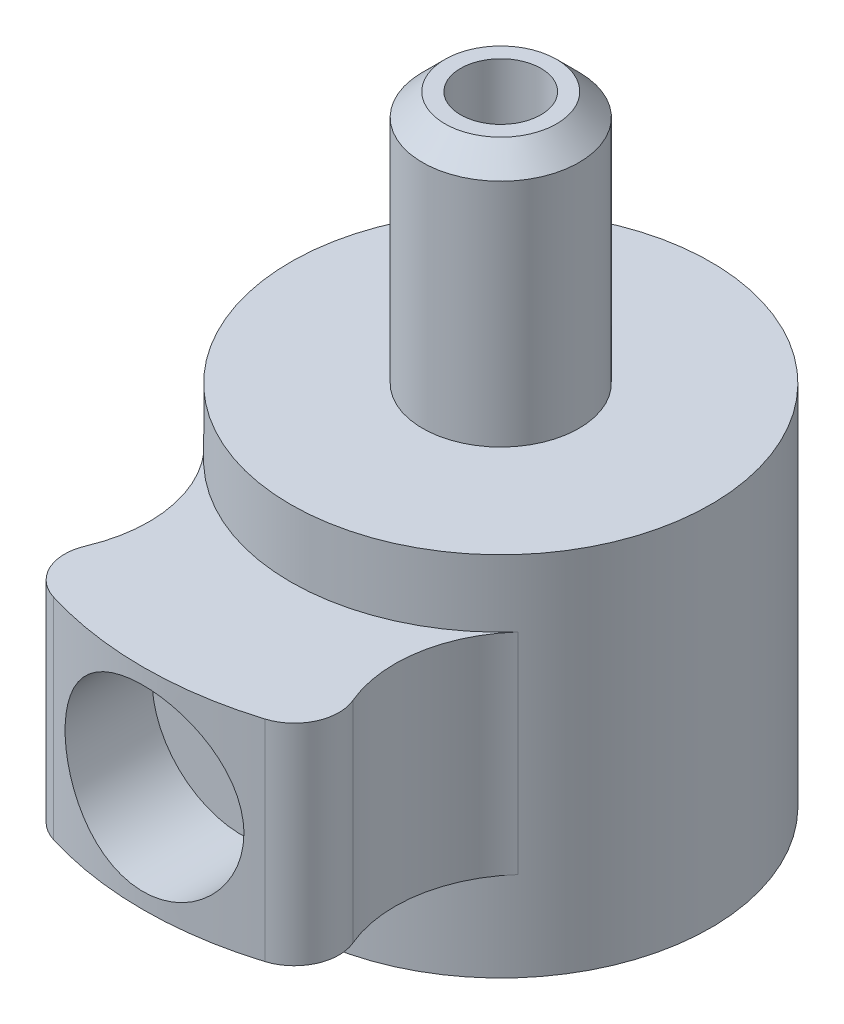
ISO-10303-21;
HEADER;
FILE_DESCRIPTION(('STEP AP214'),'2;1');
FILE_NAME('part.step','',(''),(''),'','','');
FILE_SCHEMA(('AUTOMOTIVE_DESIGN { 1 0 10303 214 1 1 1 1 }'));
ENDSEC;
DATA;
#1=APPLICATION_CONTEXT('core data for automotive mechanical design processes');
#2=APPLICATION_PROTOCOL_DEFINITION('international standard','automotive_design',2000,#1);
#3=PRODUCT_CONTEXT('',#1,'mechanical');
#4=PRODUCT('Part','Part','',(#3));
#5=PRODUCT_RELATED_PRODUCT_CATEGORY('part','',(#4));
#6=PRODUCT_DEFINITION_FORMATION('','',#4);
#7=PRODUCT_DEFINITION_CONTEXT('part definition',#1,'design');
#8=PRODUCT_DEFINITION('design','',#6,#7);
#9=PRODUCT_DEFINITION_SHAPE('','',#8);
#10=(LENGTH_UNIT() NAMED_UNIT(*) SI_UNIT(.MILLI.,.METRE.));
#11=(NAMED_UNIT(*) PLANE_ANGLE_UNIT() SI_UNIT($,.RADIAN.));
#12=(NAMED_UNIT(*) SI_UNIT($,.STERADIAN.) SOLID_ANGLE_UNIT());
#13=UNCERTAINTY_MEASURE_WITH_UNIT(LENGTH_MEASURE(1.E-05),#10,'distance_accuracy_value','');
#14=(GEOMETRIC_REPRESENTATION_CONTEXT(3) GLOBAL_UNCERTAINTY_ASSIGNED_CONTEXT((#13)) GLOBAL_UNIT_ASSIGNED_CONTEXT((#10,
#11,#12)) REPRESENTATION_CONTEXT('',''));
#15=CARTESIAN_POINT('',(0.,0.,0.));
#16=DIRECTION('',(0.,0.,1.));
#17=DIRECTION('',(1.,0.,0.));
#18=AXIS2_PLACEMENT_3D('',#15,#16,#17);
#19=CARTESIAN_POINT('',(0.,4.35,8.));
#20=DIRECTION('',(0.,0.,1.));
#21=DIRECTION('',(1.,0.,0.));
#22=AXIS2_PLACEMENT_3D('',#19,#20,#21);
#23=CYLINDRICAL_SURFACE('',#22,0.799999999999989);
#24=CARTESIAN_POINT('',(0.79999999999999,4.35,3.30454232837166));
#25=CARTESIAN_POINT('',(0.799998604853544,4.39426375756391,3.30454321037376));
#26=CARTESIAN_POINT('',(0.796313843485802,4.4385435743924,3.30544138740471));
#27=CARTESIAN_POINT('',(0.781692042569201,4.52583763979242,3.30892913746021));
#28=CARTESIAN_POINT('',(0.770750288807348,4.56885104670976,3.31151980992989));
#29=CARTESIAN_POINT('',(0.741983335663095,4.6523370042018,3.31808326909352));
#30=CARTESIAN_POINT('',(0.724166370983085,4.69281252733256,3.32205440179561));
#31=CARTESIAN_POINT('',(0.682179146705426,4.77020273129312,3.33092931117993));
#32=CARTESIAN_POINT('',(0.65800880947241,4.80711736860295,3.3358330992586));
#33=CARTESIAN_POINT('',(0.603497582949992,4.87705853668256,3.34612782427964));
#34=CARTESIAN_POINT('',(0.573055762178637,4.91000538070273,3.35152580520682));
#35=CARTESIAN_POINT('',(0.507083348356182,4.97037570264705,3.36213932660775));
#36=CARTESIAN_POINT('',(0.471552320294814,4.99779870792727,3.36735485143824));
#37=CARTESIAN_POINT('',(0.395869778023862,5.04666370971395,3.37709316623333));
#38=CARTESIAN_POINT('',(0.355666932686409,5.06802821359437,3.38160667396126));
#39=CARTESIAN_POINT('',(0.272117140458808,5.1036671209406,3.38935242786689));
#40=CARTESIAN_POINT('',(0.228770603944949,5.1179424479226,3.39258484092336));
#41=CARTESIAN_POINT('',(0.140993633396821,5.13874476638707,3.39735441310736));
#42=CARTESIAN_POINT('',(0.0965968511202841,5.14540686878142,3.39892109757437));
#43=CARTESIAN_POINT('',(0.00729001228250653,5.1512169190143,3.40028529140342));
#44=CARTESIAN_POINT('',(-0.0376199759533668,5.15036585573734,3.40008303359406));
#45=CARTESIAN_POINT('',(-0.125744085747008,5.14127258822537,3.39795439581618));
#46=CARTESIAN_POINT('',(-0.168974188717624,5.13317611902805,3.3960620127208));
#47=CARTESIAN_POINT('',(-0.253444194557819,5.11005513697513,3.39080491612124));
#48=CARTESIAN_POINT('',(-0.294683998618074,5.09503028054652,3.3874401296022));
#49=CARTESIAN_POINT('',(-0.37439669293612,5.05835582155591,3.37956298571922));
#50=CARTESIAN_POINT('',(-0.412844023280618,5.03665272441056,3.37504141336383));
#51=CARTESIAN_POINT('',(-0.485603092257449,4.98727808223394,3.36534379681458));
#52=CARTESIAN_POINT('',(-0.519914184798019,4.9596056066475,3.36016765063254));
#53=CARTESIAN_POINT('',(-0.58429496276928,4.89829044163603,3.34958069347214));
#54=CARTESIAN_POINT('',(-0.614242924654353,4.86452027514467,3.34416723239309));
#55=CARTESIAN_POINT('',(-0.668075659733524,4.79238047631,3.33383089946015));
#56=CARTESIAN_POINT('',(-0.691960211822533,4.75401067631398,3.32890804550046));
#57=CARTESIAN_POINT('',(-0.733054277700717,4.6735425735572,3.32010193553592));
#58=CARTESIAN_POINT('',(-0.750237573422676,4.63143040216961,3.31622278089562));
#59=CARTESIAN_POINT('',(-0.7772447410378,4.54480250234333,3.3099976941517));
#60=CARTESIAN_POINT('',(-0.787069986500058,4.50028722417048,3.30765147589655));
#61=CARTESIAN_POINT('',(-0.798886634509435,4.41123754267958,3.304817170585));
#62=CARTESIAN_POINT('',(-0.801056681017307,4.36672816510349,3.30428671915616));
#63=CARTESIAN_POINT('',(-0.797987783934305,4.27798350741057,3.30502919153972));
#64=CARTESIAN_POINT('',(-0.792749436914119,4.23374820551151,3.30630197014466));
#65=CARTESIAN_POINT('',(-0.775168317976514,4.14745046377477,3.31046717921145));
#66=CARTESIAN_POINT('',(-0.762926804509054,4.10536617530986,3.3133365093543));
#67=CARTESIAN_POINT('',(-0.731797823701936,4.02384639846666,3.32035011935363));
#68=CARTESIAN_POINT('',(-0.712909640388007,3.98441119599115,3.3244945365555));
#69=CARTESIAN_POINT('',(-0.668640078279623,3.90854421775662,3.3336824259049));
#70=CARTESIAN_POINT('',(-0.643150316083848,3.87217748307256,3.33874043169574));
#71=CARTESIAN_POINT('',(-0.586540496532733,3.80417193908381,3.34914866018982));
#72=CARTESIAN_POINT('',(-0.555419624205654,3.77253381534701,3.35449892511241));
#73=CARTESIAN_POINT('',(-0.487616637245103,3.7141746804257,3.36503050843004));
#74=CARTESIAN_POINT('',(-0.450827746323671,3.68757639432678,3.370205569405));
#75=CARTESIAN_POINT('',(-0.373200963518472,3.64093657132093,3.37968159158292));
#76=CARTESIAN_POINT('',(-0.332363274464459,3.62089470617772,3.38398259653996));
#77=CARTESIAN_POINT('',(-0.248069771459096,3.58809973256274,3.39119987995177));
#78=CARTESIAN_POINT('',(-0.204634189931106,3.57529679475447,3.39412560107054));
#79=CARTESIAN_POINT('',(-0.116151072350095,3.55719026566033,3.39830377407843));
#80=CARTESIAN_POINT('',(-0.0711038110727765,3.55188540221391,3.39955650981256));
#81=CARTESIAN_POINT('',(0.0181652939843413,3.5489902529377,3.40023750537373));
#82=CARTESIAN_POINT('',(0.062380998597955,3.55121786188949,3.39970883363818));
#83=CARTESIAN_POINT('',(0.149789044922906,3.5629120700921,3.3969803510083));
#84=CARTESIAN_POINT('',(0.192981410922304,3.57237849735801,3.39478057981714));
#85=CARTESIAN_POINT('',(0.276950110243137,3.59818879841435,3.38896207325541));
#86=CARTESIAN_POINT('',(0.317735964938134,3.61450315861507,3.38534943165835));
#87=CARTESIAN_POINT('',(0.396013765353372,3.6535187261056,3.3770880965855));
#88=CARTESIAN_POINT('',(0.433505339179073,3.67622065328147,3.37243928634463));
#89=CARTESIAN_POINT('',(0.505006165498286,3.72794099127646,3.36248438194576));
#90=CARTESIAN_POINT('',(0.538922754078283,3.75708519790852,3.35716626354667));
#91=CARTESIAN_POINT('',(0.601445897097706,3.82061388897884,3.34653117447955));
#92=CARTESIAN_POINT('',(0.630051139203705,3.85499966469834,3.34121420441853));
#93=CARTESIAN_POINT('',(0.681585676235505,3.92869832358532,3.33108742985021));
#94=CARTESIAN_POINT('',(0.704416720440091,3.96808130308556,3.32628711270982));
#95=CARTESIAN_POINT('',(0.743099584973279,4.0502321488081,3.31786042879568));
#96=CARTESIAN_POINT('',(0.758956892918538,4.09299732221021,3.31423313956606));
#97=CARTESIAN_POINT('',(0.780650248439628,4.17145688863508,3.30918120129895));
#98=CARTESIAN_POINT('',(0.787891539204312,4.20674992335564,3.30745394394094));
#99=CARTESIAN_POINT('',(0.797566824226479,4.27802512955251,3.3051341861726));
#100=CARTESIAN_POINT('',(0.80000113445292,4.31400725557699,3.30454161117824));
#101=CARTESIAN_POINT('',(0.79999999999999,4.35,3.30454232837166));
#102=B_SPLINE_CURVE_WITH_KNOTS('',3,(#24,#25,#26,#27,#28,#29,#30,#31,#32,#33,#34,#35,#36,#37,
#38,#39,#40,#41,#42,#43,#44,#45,#46,#47,#48,#49,#50,#51,#52,#53,#54,#55,#56,#57,#58,#59,#60,#61,
#62,#63,#64,#65,#66,#67,#68,#69,#70,#71,#72,#73,#74,#75,#76,#77,#78,#79,#80,#81,#82,#83,#84,#85,
#86,#87,#88,#89,#90,#91,#92,#93,#94,#95,#96,#97,#98,#99,#100,#101),.UNSPECIFIED.,.T.,.F.,(4,2,2,
2,2,2,2,2,2,2,2,2,2,2,2,2,2,2,2,2,2,2,2,2,2,2,2,2,2,2,2,2,2,2,2,2,2,2,4),(0.,0.132659230314079,
0.265404721873799,0.397991710141676,0.530580318638497,0.665497920554681,0.800427061715096,
0.937011317755035,1.07357777611783,1.20768101501322,1.3417666034742,1.47321433089912,
1.60466857740937,1.7372044986078,1.86976109553144,2.00550280029183,2.14124945422651,
2.27752200083875,2.41376910233417,2.54681486555971,2.67984991570916,2.81100835307798,
2.94218092306192,3.07566109422861,3.2091605990082,3.34558091204578,3.48199439438217,
3.6174570678504,3.75289675528848,3.88508569129767,4.01727148676701,4.14889333725167,
4.2805300276142,4.41500887591735,4.54952090731742,4.68618742942708,4.82274621570191,
4.93062417088764,5.0384950348818),.UNSPECIFIED.);
#103=CARTESIAN_POINT('',(0.79999999999999,4.35,3.30454232837166));
#104=VERTEX_POINT('',#103);
#105=EDGE_CURVE('E123',#104,#104,#102,.T.);
#106=ORIENTED_EDGE('',*,*,#105,.F.);
#107=EDGE_LOOP('',(#106));
#108=FACE_BOUND('',#107,.T.);
#109=CARTESIAN_POINT('',(0.,4.35,5.8));
#110=DIRECTION('',(0.,0.,1.));
#111=DIRECTION('',(1.,0.,0.));
#112=AXIS2_PLACEMENT_3D('',#109,#110,#111);
#113=CIRCLE('',#112,0.799999999999989);
#114=CARTESIAN_POINT('',(0.79999999999999,4.35,5.8));
#115=VERTEX_POINT('',#114);
#116=EDGE_CURVE('E190',#115,#115,#113,.F.);
#117=ORIENTED_EDGE('',*,*,#116,.F.);
#118=EDGE_LOOP('',(#117));
#119=FACE_BOUND('',#118,.T.);
#120=ADVANCED_FACE('F49',(#108,#119),#23,.F.);
#121=CARTESIAN_POINT('',(0.,0.,0.));
#122=DIRECTION('',(0.,-1.,0.));
#123=DIRECTION('',(0.,0.,-1.));
#124=AXIS2_PLACEMENT_3D('',#121,#122,#123);
#125=CYLINDRICAL_SURFACE('',#124,8.);
#126=CARTESIAN_POINT('',(2.,4.35,7.74596669241483));
#127=CARTESIAN_POINT('',(1.99999686287446,4.23955939925874,7.74596880070288));
#128=CARTESIAN_POINT('',(1.99082099639812,4.12908408105718,7.74835444811678));
#129=CARTESIAN_POINT('',(1.95441850037104,3.91130593746119,7.75761489594051));
#130=CARTESIAN_POINT('',(1.92718136539368,3.80400499642545,7.76449230897304));
#131=CARTESIAN_POINT('',(1.85559295970563,3.59575716945025,7.7819097967692));
#132=CARTESIAN_POINT('',(1.81126378228359,3.49480227569143,7.79244514152366));
#133=CARTESIAN_POINT('',(1.70681691300911,3.30175131796809,7.81598553623007));
#134=CARTESIAN_POINT('',(1.64669855084855,3.20965563033583,7.82899069102791));
#135=CARTESIAN_POINT('',(1.51096674184951,3.03491068379023,7.856325730845));
#136=CARTESIAN_POINT('',(1.43506951016324,2.95248511971996,7.87067678098427));
#137=CARTESIAN_POINT('',(1.27054565128053,2.80139088451173,7.89890300412235));
#138=CARTESIAN_POINT('',(1.18191783534425,2.7327234995026,7.91277813253111));
#139=CARTESIAN_POINT('',(0.992916160863164,2.61017962589498,7.93872332416466));
#140=CARTESIAN_POINT('',(0.892395660956097,2.55652288947083,7.95076549920474));
#141=CARTESIAN_POINT('',(0.68341054743421,2.46695228467753,7.97144649540787));
#142=CARTESIAN_POINT('',(0.574947108633553,2.43103579846759,7.98008581867475));
#143=CARTESIAN_POINT('',(0.35548700700333,2.37868173233713,7.99283807078544));
#144=CARTESIAN_POINT('',(0.244586175639181,2.36186428453873,7.99703915075451));
#145=CARTESIAN_POINT('',(0.021463055410216,2.34699329657956,8.00074875285838));
#146=CARTESIAN_POINT('',(-0.0907590356304544,2.34893698223232,8.00025796877363));
#147=CARTESIAN_POINT('',(-0.310704494344774,2.37125988020011,7.99470475962828));
#148=CARTESIAN_POINT('',(-0.418472431202134,2.39122906004308,7.98974401872699));
#149=CARTESIAN_POINT('',(-0.629076494827372,2.4483770160388,7.97592669219883));
#150=CARTESIAN_POINT('',(-0.731912358740876,2.48555670830193,7.96706989918753));
#151=CARTESIAN_POINT('',(-0.930813407003613,2.57640205654965,7.94630007760717));
#152=CARTESIAN_POINT('',(-1.02680901953301,2.6302136357294,7.93436015756043));
#153=CARTESIAN_POINT('',(-1.20855124468098,2.75268454329301,7.90871923047719));
#154=CARTESIAN_POINT('',(-1.29429607017101,2.8213464548485,7.89501791721992));
#155=CARTESIAN_POINT('',(-1.45554807016991,2.9737669935859,7.86690971015616));
#156=CARTESIAN_POINT('',(-1.5307153581504,3.05788391387822,7.85249375620734));
#157=CARTESIAN_POINT('',(-1.66595275192604,3.2376799788322,7.82492034813365));
#158=CARTESIAN_POINT('',(-1.72602215209203,3.3333596635928,7.81176295284776));
#159=CARTESIAN_POINT('',(-1.8295762580452,3.53423202731917,7.78816397465319));
#160=CARTESIAN_POINT('',(-1.87297913394098,3.63946858425056,7.77773586980577));
#161=CARTESIAN_POINT('',(-1.94137124127268,3.85606837446116,7.76094912111966));
#162=CARTESIAN_POINT('',(-1.96636441310582,3.96743029118651,7.75458960648175));
#163=CARTESIAN_POINT('',(-1.99666371093214,4.1899676012185,7.74684284831313));
#164=CARTESIAN_POINT('',(-2.0024723791357,4.3010702346637,7.74532871274919));
#165=CARTESIAN_POINT('',(-1.99561359241244,4.52265754926253,7.74709874784831));
#166=CARTESIAN_POINT('',(-1.98294783827904,4.63314228636099,7.75038247681013));
#167=CARTESIAN_POINT('',(-1.93994037115013,4.84849141196377,7.76125665563648));
#168=CARTESIAN_POINT('',(-1.9098912546254,4.95341818125667,7.768775761875));
#169=CARTESIAN_POINT('',(-1.8332944653365,5.15674516628135,7.7872057461677));
#170=CARTESIAN_POINT('',(-1.78674483817004,5.25514460724427,7.79811702598891));
#171=CARTESIAN_POINT('',(-1.67741653434924,5.44475302229388,7.8223690967461));
#172=CARTESIAN_POINT('',(-1.6143374030685,5.53578307203448,7.83575334885313));
#173=CARTESIAN_POINT('',(-1.47412058586891,5.70615069024108,7.86333666457373));
#174=CARTESIAN_POINT('',(-1.39698058961088,5.78548633332006,7.87753586182776));
#175=CARTESIAN_POINT('',(-1.22852544196945,5.93224883405677,7.90557922425285));
#176=CARTESIAN_POINT('',(-1.13690390506318,5.99932805003905,7.91940561649468));
#177=CARTESIAN_POINT('',(-0.943405365389349,6.117148693561,7.94477773290987));
#178=CARTESIAN_POINT('',(-0.84152889791518,6.16789097328656,7.95632357603169));
#179=CARTESIAN_POINT('',(-0.63111640346218,6.25115682762235,7.9757609259065));
#180=CARTESIAN_POINT('',(-0.522634762055763,6.28381142750325,7.98367864017925));
#181=CARTESIAN_POINT('',(-0.301499520637613,6.33036826768673,7.99508234716634));
#182=CARTESIAN_POINT('',(-0.18884673008248,6.34427412699123,7.99856919514738));
#183=CARTESIAN_POINT('',(0.0341670528866473,6.35273517915108,8.00068338817612));
#184=CARTESIAN_POINT('',(0.144507653932044,6.34780341819082,7.99943957759977));
#185=CARTESIAN_POINT('',(0.362734992829502,6.3199043454113,7.99251792914887));
#186=CARTESIAN_POINT('',(0.470621803561858,6.29693756997366,7.98684022314338));
#187=CARTESIAN_POINT('',(0.680342071289549,6.23389556045828,7.97170865707778));
#188=CARTESIAN_POINT('',(0.782204989161727,6.19391309337124,7.96227529004785));
#189=CARTESIAN_POINT('',(0.977834106083249,6.09805884196086,7.94062577827316));
#190=CARTESIAN_POINT('',(1.07159928253127,6.04218505465903,7.92840928277515));
#191=CARTESIAN_POINT('',(1.25080385684661,5.91456953200773,7.90214499360574));
#192=CARTESIAN_POINT('',(1.33598997659667,5.84247971419234,7.88806033883329));
#193=CARTESIAN_POINT('',(1.49323004054701,5.68515429604531,7.85981298114379));
#194=CARTESIAN_POINT('',(1.56528065015318,5.59991536777767,7.84565025934604));
#195=CARTESIAN_POINT('',(1.69552405294366,5.41679717162108,7.81854951691005));
#196=CARTESIAN_POINT('',(1.75343323883276,5.31871175326949,7.80563927346578));
#197=CARTESIAN_POINT('',(1.85185379317094,5.11388902025036,7.78287910989656));
#198=CARTESIAN_POINT('',(1.89237781950431,5.00715806781231,7.77302696466428));
#199=CARTESIAN_POINT('',(1.94884505714201,4.80884597632968,7.75903817501475));
#200=CARTESIAN_POINT('',(1.96798634119376,4.71821367122773,7.75417326006998));
#201=CARTESIAN_POINT('',(1.99356458514354,4.53506226200462,7.7476367716524));
#202=CARTESIAN_POINT('',(2.0000026287435,4.4425433195112,7.74596492578215));
#203=CARTESIAN_POINT('',(2.,4.35,7.74596669241483));
#204=B_SPLINE_CURVE_WITH_KNOTS('',3,(#126,#127,#128,#129,#130,#131,#132,#133,#134,#135,#136,
#137,#138,#139,#140,#141,#142,#143,#144,#145,#146,#147,#148,#149,#150,#151,#152,#153,#154,#155,
#156,#157,#158,#159,#160,#161,#162,#163,#164,#165,#166,#167,#168,#169,#170,#171,#172,#173,#174,
#175,#176,#177,#178,#179,#180,#181,#182,#183,#184,#185,#186,#187,#188,#189,#190,#191,#192,#193,
#194,#195,#196,#197,#198,#199,#200,#201,#202,#203),.UNSPECIFIED.,.T.,.F.,(4,2,2,2,2,2,2,2,2,2,2,
2,2,2,2,2,2,2,2,2,2,2,2,2,2,2,2,2,2,2,2,2,2,2,2,2,2,2,4),(0.,0.33098195338891,0.662156593142933,
0.992904581732817,1.32366661404383,1.66099163354381,1.99834817183893,2.34041197118336,
2.68242527877674,3.01751000796277,3.35254518932816,3.68014610151158,4.00776445379829,
4.33834299403556,4.66897908375131,5.0085637325753,5.34816424959842,5.68941145606722,
6.03058560103638,6.36274859809374,6.69488101747042,7.02157924007366,7.34831617137135,
7.68146276687326,8.01466415108036,8.35620264772255,8.69772332575643,9.03673658245544,
9.37568439127231,9.70546756901965,10.0352409390158,10.3632390124777,10.6912784459046,
11.0271767726566,11.3631602525241,11.7054118182895,12.0474137709606,12.3247826174462,
12.6021278008238),.UNSPECIFIED.);
#205=CARTESIAN_POINT('',(2.,4.35,7.74596669241483));
#206=VERTEX_POINT('',#205);
#207=EDGE_CURVE('E12',#206,#206,#204,.T.);
#208=ORIENTED_EDGE('',*,*,#207,.T.);
#209=EDGE_LOOP('',(#208));
#210=FACE_BOUND('',#209,.T.);
#211=CARTESIAN_POINT('',(0.,2.,0.));
#212=DIRECTION('',(0.,-1.,0.));
#213=DIRECTION('',(0.,0.,-1.));
#214=AXIS2_PLACEMENT_3D('',#211,#212,#213);
#215=CIRCLE('',#214,8.);
#216=CARTESIAN_POINT('',(2.36484696607376,2.,7.64247988725203));
#217=VERTEX_POINT('',#216);
#218=CARTESIAN_POINT('',(-2.36484696607376,2.,7.64247988725203));
#219=VERTEX_POINT('',#218);
#220=EDGE_CURVE('E292',#217,#219,#215,.T.);
#221=ORIENTED_EDGE('',*,*,#220,.F.);
#222=DIRECTION('',(0.,-1.,0.));
#223=VECTOR('',#222,1.);
#224=CARTESIAN_POINT('',(2.36484696607376,0.,7.64247988725203));
#225=LINE('',#224,#223);
#226=CARTESIAN_POINT('',(2.36484696607376,6.7,7.64247988725203));
#227=VERTEX_POINT('',#226);
#228=EDGE_CURVE('E173',#217,#227,#225,.F.);
#229=ORIENTED_EDGE('',*,*,#228,.T.);
#230=CARTESIAN_POINT('',(0.,6.7,0.));
#231=DIRECTION('',(0.,1.,0.));
#232=DIRECTION('',(0.,0.,1.));
#233=AXIS2_PLACEMENT_3D('',#230,#231,#232);
#234=CIRCLE('',#233,8.);
#235=CARTESIAN_POINT('',(-2.36484696607376,6.7,7.64247988725203));
#236=VERTEX_POINT('',#235);
#237=EDGE_CURVE('E282',#236,#227,#234,.T.);
#238=ORIENTED_EDGE('',*,*,#237,.F.);
#239=DIRECTION('',(0.,-1.,0.));
#240=VECTOR('',#239,1.);
#241=CARTESIAN_POINT('',(-2.36484696607376,0.,7.64247988725203));
#242=LINE('',#241,#240);
#243=EDGE_CURVE('E169',#236,#219,#242,.T.);
#244=ORIENTED_EDGE('',*,*,#243,.T.);
#245=EDGE_LOOP('',(#221,#229,#238,#244));
#246=FACE_BOUND('',#245,.T.);
#247=ADVANCED_FACE('F217',(#210,#246),#125,.T.);
#248=CARTESIAN_POINT('',(5.75,0.,5.12127913709065));
#249=DIRECTION('',(0.,1.,0.));
#250=DIRECTION('',(0.,0.,1.));
#251=AXIS2_PLACEMENT_3D('',#248,#249,#250);
#252=CYLINDRICAL_SURFACE('',#251,3.);
#253=CARTESIAN_POINT('',(5.75,2.,5.12127913709065));
#254=DIRECTION('',(0.,-1.,0.));
#255=DIRECTION('',(0.,0.,-1.));
#256=AXIS2_PLACEMENT_3D('',#253,#254,#255);
#257=CIRCLE('',#256,3.);
#258=CARTESIAN_POINT('',(3.50974025974026,2.,3.1259755771852));
#259=VERTEX_POINT('',#258);
#260=CARTESIAN_POINT('',(2.9894308214859,2.,6.29569721028181));
#261=VERTEX_POINT('',#260);
#262=EDGE_CURVE('E115',#259,#261,#257,.F.);
#263=ORIENTED_EDGE('',*,*,#262,.F.);
#264=DIRECTION('',(0.,1.,0.));
#265=VECTOR('',#264,1.);
#266=CARTESIAN_POINT('',(3.50974025974026,0.,3.12597557718521));
#267=LINE('',#266,#265);
#268=CARTESIAN_POINT('',(3.50974025974026,6.7,3.1259755771852));
#269=VERTEX_POINT('',#268);
#270=EDGE_CURVE('E128',#259,#269,#267,.T.);
#271=ORIENTED_EDGE('',*,*,#270,.T.);
#272=CARTESIAN_POINT('',(5.75,6.7,5.12127913709065));
#273=DIRECTION('',(0.,1.,0.));
#274=DIRECTION('',(0.,0.,1.));
#275=AXIS2_PLACEMENT_3D('',#272,#273,#274);
#276=CIRCLE('',#275,3.);
#277=CARTESIAN_POINT('',(2.9894308214859,6.7,6.29569721028181));
#278=VERTEX_POINT('',#277);
#279=EDGE_CURVE('E276',#278,#269,#276,.F.);
#280=ORIENTED_EDGE('',*,*,#279,.F.);
#281=DIRECTION('',(0.,1.,0.));
#282=VECTOR('',#281,1.);
#283=CARTESIAN_POINT('',(2.9894308214859,0.,6.29569721028181));
#284=LINE('',#283,#282);
#285=EDGE_CURVE('E130',#278,#261,#284,.F.);
#286=ORIENTED_EDGE('',*,*,#285,.T.);
#287=EDGE_LOOP('',(#263,#271,#280,#286));
#288=FACE_BOUND('',#287,.T.);
#289=ADVANCED_FACE('F127',(#288),#252,.F.);
#290=CARTESIAN_POINT('',(-5.75,0.,5.12127913709065));
#291=DIRECTION('',(0.,1.,0.));
#292=DIRECTION('',(0.,0.,1.));
#293=AXIS2_PLACEMENT_3D('',#290,#291,#292);
#294=CYLINDRICAL_SURFACE('',#293,3.);
#295=CARTESIAN_POINT('',(-5.75,2.,5.12127913709065));
#296=DIRECTION('',(0.,-1.,0.));
#297=DIRECTION('',(0.,0.,-1.));
#298=AXIS2_PLACEMENT_3D('',#295,#296,#297);
#299=CIRCLE('',#298,3.);
#300=CARTESIAN_POINT('',(-2.9894308214859,2.,6.29569721028181));
#301=VERTEX_POINT('',#300);
#302=CARTESIAN_POINT('',(-3.50974025974026,2.,3.12597557718521));
#303=VERTEX_POINT('',#302);
#304=EDGE_CURVE('E117',#301,#303,#299,.F.);
#305=ORIENTED_EDGE('',*,*,#304,.F.);
#306=DIRECTION('',(0.,1.,0.));
#307=VECTOR('',#306,1.);
#308=CARTESIAN_POINT('',(-2.9894308214859,0.,6.29569721028181));
#309=LINE('',#308,#307);
#310=CARTESIAN_POINT('',(-2.9894308214859,6.7,6.29569721028181));
#311=VERTEX_POINT('',#310);
#312=EDGE_CURVE('E71',#301,#311,#309,.T.);
#313=ORIENTED_EDGE('',*,*,#312,.T.);
#314=CARTESIAN_POINT('',(-5.75,6.7,5.12127913709065));
#315=DIRECTION('',(0.,1.,0.));
#316=DIRECTION('',(0.,0.,1.));
#317=AXIS2_PLACEMENT_3D('',#314,#315,#316);
#318=CIRCLE('',#317,3.);
#319=CARTESIAN_POINT('',(-3.50974025974026,6.7,3.12597557718521));
#320=VERTEX_POINT('',#319);
#321=EDGE_CURVE('E285',#320,#311,#318,.F.);
#322=ORIENTED_EDGE('',*,*,#321,.F.);
#323=DIRECTION('',(0.,1.,0.));
#324=VECTOR('',#323,1.);
#325=CARTESIAN_POINT('',(-3.50974025974026,0.,3.12597557718521));
#326=LINE('',#325,#324);
#327=EDGE_CURVE('E141',#303,#320,#326,.T.);
#328=ORIENTED_EDGE('',*,*,#327,.F.);
#329=EDGE_LOOP('',(#305,#313,#322,#328));
#330=FACE_BOUND('',#329,.T.);
#331=ADVANCED_FACE('F230',(#330),#294,.F.);
#332=CARTESIAN_POINT('',(2.06924109531454,0.,6.68716990134552));
#333=DIRECTION('',(0.,-1.,0.));
#334=DIRECTION('',(0.,0.,-1.));
#335=AXIS2_PLACEMENT_3D('',#332,#333,#334);
#336=CYLINDRICAL_SURFACE('',#335,1.);
#337=ORIENTED_EDGE('',*,*,#228,.F.);
#338=CARTESIAN_POINT('',(2.06924109531454,2.,6.68716990134552));
#339=DIRECTION('',(0.,-1.,0.));
#340=DIRECTION('',(0.,0.,-1.));
#341=AXIS2_PLACEMENT_3D('',#338,#339,#340);
#342=CIRCLE('',#341,1.);
#343=EDGE_CURVE('E133',#217,#261,#342,.F.);
#344=ORIENTED_EDGE('',*,*,#343,.T.);
#345=ORIENTED_EDGE('',*,*,#285,.F.);
#346=CARTESIAN_POINT('',(2.06924109531454,6.7,6.68716990134552));
#347=DIRECTION('',(0.,1.,0.));
#348=DIRECTION('',(0.,0.,1.));
#349=AXIS2_PLACEMENT_3D('',#346,#347,#348);
#350=CIRCLE('',#349,1.);
#351=EDGE_CURVE('E79',#278,#227,#350,.F.);
#352=ORIENTED_EDGE('',*,*,#351,.T.);
#353=EDGE_LOOP('',(#337,#344,#345,#352));
#354=FACE_BOUND('',#353,.T.);
#355=ADVANCED_FACE('F233',(#354),#336,.T.);
#356=CARTESIAN_POINT('',(-2.06924109531454,0.,6.68716990134552));
#357=DIRECTION('',(0.,1.,0.));
#358=DIRECTION('',(0.,0.,1.));
#359=AXIS2_PLACEMENT_3D('',#356,#357,#358);
#360=CYLINDRICAL_SURFACE('',#359,1.);
#361=ORIENTED_EDGE('',*,*,#312,.F.);
#362=CARTESIAN_POINT('',(-2.06924109531454,2.,6.68716990134552));
#363=DIRECTION('',(0.,-1.,0.));
#364=DIRECTION('',(0.,0.,-1.));
#365=AXIS2_PLACEMENT_3D('',#362,#363,#364);
#366=CIRCLE('',#365,1.);
#367=EDGE_CURVE('E122',#301,#219,#366,.F.);
#368=ORIENTED_EDGE('',*,*,#367,.T.);
#369=ORIENTED_EDGE('',*,*,#243,.F.);
#370=CARTESIAN_POINT('',(-2.06924109531454,6.7,6.68716990134552));
#371=DIRECTION('',(0.,1.,0.));
#372=DIRECTION('',(0.,0.,1.));
#373=AXIS2_PLACEMENT_3D('',#370,#371,#372);
#374=CIRCLE('',#373,1.);
#375=EDGE_CURVE('E180',#236,#311,#374,.F.);
#376=ORIENTED_EDGE('',*,*,#375,.T.);
#377=EDGE_LOOP('',(#361,#368,#369,#376));
#378=FACE_BOUND('',#377,.T.);
#379=ADVANCED_FACE('F270',(#378),#360,.T.);
#380=CARTESIAN_POINT('',(0.,0.,8.));
#381=DIRECTION('',(0.,1.,0.));
#382=DIRECTION('',(0.,0.,1.));
#383=AXIS2_PLACEMENT_3D('',#380,#381,#382);
#384=PLANE('',#383);
#385=CARTESIAN_POINT('',(0.,0.,0.));
#386=DIRECTION('',(0.,-1.,0.));
#387=DIRECTION('',(0.,0.,-1.));
#388=AXIS2_PLACEMENT_3D('',#385,#386,#387);
#389=CIRCLE('',#388,3.4);
#390=CARTESIAN_POINT('',(0.,0.,-3.4));
#391=VERTEX_POINT('',#390);
#392=EDGE_CURVE('E165',#391,#391,#389,.T.);
#393=ORIENTED_EDGE('',*,*,#392,.F.);
#394=EDGE_LOOP('',(#393));
#395=FACE_BOUND('',#394,.T.);
#396=CARTESIAN_POINT('',(0.,0.,0.));
#397=DIRECTION('',(0.,-1.,0.));
#398=DIRECTION('',(0.,0.,1.));
#399=AXIS2_PLACEMENT_3D('',#396,#397,#398);
#400=CIRCLE('',#399,4.7);
#401=CARTESIAN_POINT('',(0.,0.,4.7));
#402=VERTEX_POINT('',#401);
#403=EDGE_CURVE('E148',#402,#402,#400,.T.);
#404=ORIENTED_EDGE('',*,*,#403,.T.);
#405=EDGE_LOOP('',(#404));
#406=FACE_BOUND('',#405,.T.);
#407=ADVANCED_FACE('F242',(#395,#406),#384,.F.);
#408=CARTESIAN_POINT('',(0.,8.2,1.75));
#409=DIRECTION('',(0.,-1.,0.));
#410=DIRECTION('',(0.,0.,-1.));
#411=AXIS2_PLACEMENT_3D('',#408,#409,#410);
#412=PLANE('',#411);
#413=CARTESIAN_POINT('',(0.,8.2,0.));
#414=DIRECTION('',(0.,-1.,0.));
#415=DIRECTION('',(0.,0.,-1.));
#416=AXIS2_PLACEMENT_3D('',#413,#414,#415);
#417=CIRCLE('',#416,1.75);
#418=CARTESIAN_POINT('',(0.,8.2,-1.75));
#419=VERTEX_POINT('',#418);
#420=EDGE_CURVE('E140',#419,#419,#417,.T.);
#421=ORIENTED_EDGE('',*,*,#420,.T.);
#422=EDGE_LOOP('',(#421));
#423=FACE_BOUND('',#422,.T.);
#424=CARTESIAN_POINT('',(0.,8.2,0.));
#425=DIRECTION('',(0.,-1.,0.));
#426=DIRECTION('',(0.,0.,1.));
#427=AXIS2_PLACEMENT_3D('',#424,#425,#426);
#428=CIRCLE('',#427,4.7);
#429=CARTESIAN_POINT('',(0.,8.2,4.7));
#430=VERTEX_POINT('',#429);
#431=EDGE_CURVE('E151',#430,#430,#428,.T.);
#432=ORIENTED_EDGE('',*,*,#431,.F.);
#433=EDGE_LOOP('',(#432));
#434=FACE_BOUND('',#433,.T.);
#435=ADVANCED_FACE('F239',(#423,#434),#412,.F.);
#436=CARTESIAN_POINT('',(0.,0.,0.));
#437=DIRECTION('',(0.,-1.,0.));
#438=DIRECTION('',(0.,0.,-1.));
#439=AXIS2_PLACEMENT_3D('',#436,#437,#438);
#440=CYLINDRICAL_SURFACE('',#439,3.4);
#441=ORIENTED_EDGE('',*,*,#105,.T.);
#442=EDGE_LOOP('',(#441));
#443=FACE_BOUND('',#442,.T.);
#444=CARTESIAN_POINT('',(0.,6.5,0.));
#445=DIRECTION('',(0.,-1.,0.));
#446=DIRECTION('',(0.,0.,-1.));
#447=AXIS2_PLACEMENT_3D('',#444,#445,#446);
#448=CIRCLE('',#447,3.4);
#449=CARTESIAN_POINT('',(0.,6.5,-3.4));
#450=VERTEX_POINT('',#449);
#451=EDGE_CURVE('E161',#450,#450,#448,.T.);
#452=ORIENTED_EDGE('',*,*,#451,.F.);
#453=EDGE_LOOP('',(#452));
#454=FACE_BOUND('',#453,.T.);
#455=ORIENTED_EDGE('',*,*,#392,.T.);
#456=EDGE_LOOP('',(#455));
#457=FACE_BOUND('',#456,.T.);
#458=ADVANCED_FACE('F210',(#443,#454,#457),#440,.F.);
#459=CARTESIAN_POINT('',(0.,6.5,3.4));
#460=DIRECTION('',(0.,1.,0.));
#461=DIRECTION('',(0.,0.,1.));
#462=AXIS2_PLACEMENT_3D('',#459,#460,#461);
#463=PLANE('',#462);
#464=CARTESIAN_POINT('',(0.,6.5,0.));
#465=DIRECTION('',(0.,-1.,0.));
#466=DIRECTION('',(0.,0.,-1.));
#467=AXIS2_PLACEMENT_3D('',#464,#465,#466);
#468=CIRCLE('',#467,0.9);
#469=CARTESIAN_POINT('',(0.,6.5,-0.9));
#470=VERTEX_POINT('',#469);
#471=EDGE_CURVE('E157',#470,#470,#468,.T.);
#472=ORIENTED_EDGE('',*,*,#471,.F.);
#473=EDGE_LOOP('',(#472));
#474=FACE_BOUND('',#473,.T.);
#475=ORIENTED_EDGE('',*,*,#451,.T.);
#476=EDGE_LOOP('',(#475));
#477=FACE_BOUND('',#476,.T.);
#478=ADVANCED_FACE('F253',(#474,#477),#463,.F.);
#479=CARTESIAN_POINT('',(0.,0.,0.));
#480=DIRECTION('',(0.,-1.,0.));
#481=DIRECTION('',(0.,0.,-1.));
#482=AXIS2_PLACEMENT_3D('',#479,#480,#481);
#483=CYLINDRICAL_SURFACE('',#482,0.9);
#484=CARTESIAN_POINT('',(0.,13.85,0.));
#485=DIRECTION('',(0.,-1.,0.));
#486=DIRECTION('',(0.,0.,-1.));
#487=AXIS2_PLACEMENT_3D('',#484,#485,#486);
#488=CIRCLE('',#487,0.9);
#489=CARTESIAN_POINT('',(0.,13.85,-0.9));
#490=VERTEX_POINT('',#489);
#491=EDGE_CURVE('E146',#490,#490,#488,.T.);
#492=ORIENTED_EDGE('',*,*,#491,.F.);
#493=EDGE_LOOP('',(#492));
#494=FACE_BOUND('',#493,.T.);
#495=ORIENTED_EDGE('',*,*,#471,.T.);
#496=EDGE_LOOP('',(#495));
#497=FACE_BOUND('',#496,.T.);
#498=ADVANCED_FACE('F250',(#494,#497),#483,.F.);
#499=CARTESIAN_POINT('',(0.,13.85,0.9));
#500=DIRECTION('',(0.,-1.,0.));
#501=DIRECTION('',(0.,0.,-1.));
#502=AXIS2_PLACEMENT_3D('',#499,#500,#501);
#503=PLANE('',#502);
#504=CARTESIAN_POINT('',(0.,13.85,0.));
#505=DIRECTION('',(0.,-1.,0.));
#506=DIRECTION('',(0.,0.,-1.));
#507=AXIS2_PLACEMENT_3D('',#504,#505,#506);
#508=CIRCLE('',#507,1.25);
#509=CARTESIAN_POINT('',(0.,13.85,-1.25));
#510=VERTEX_POINT('',#509);
#511=EDGE_CURVE('E64',#510,#510,#508,.F.);
#512=ORIENTED_EDGE('',*,*,#511,.T.);
#513=EDGE_LOOP('',(#512));
#514=FACE_BOUND('',#513,.T.);
#515=ORIENTED_EDGE('',*,*,#491,.T.);
#516=EDGE_LOOP('',(#515));
#517=FACE_BOUND('',#516,.T.);
#518=ADVANCED_FACE('F246',(#514,#517),#503,.F.);
#519=CARTESIAN_POINT('',(0.,0.,0.));
#520=DIRECTION('',(0.,-1.,0.));
#521=DIRECTION('',(0.,0.,-1.));
#522=AXIS2_PLACEMENT_3D('',#519,#520,#521);
#523=CYLINDRICAL_SURFACE('',#522,1.75);
#524=CARTESIAN_POINT('',(0.,13.35,0.));
#525=DIRECTION('',(0.,-1.,0.));
#526=DIRECTION('',(0.,0.,-1.));
#527=AXIS2_PLACEMENT_3D('',#524,#525,#526);
#528=CIRCLE('',#527,1.75);
#529=CARTESIAN_POINT('',(0.,13.35,-1.75));
#530=VERTEX_POINT('',#529);
#531=EDGE_CURVE('E184',#530,#530,#528,.T.);
#532=ORIENTED_EDGE('',*,*,#531,.T.);
#533=EDGE_LOOP('',(#532));
#534=FACE_BOUND('',#533,.T.);
#535=ORIENTED_EDGE('',*,*,#420,.F.);
#536=EDGE_LOOP('',(#535));
#537=FACE_BOUND('',#536,.T.);
#538=ADVANCED_FACE('F229',(#534,#537),#523,.T.);
#539=CARTESIAN_POINT('',(0.,0.,0.));
#540=DIRECTION('',(0.,1.,0.));
#541=DIRECTION('',(0.,0.,1.));
#542=AXIS2_PLACEMENT_3D('',#539,#540,#541);
#543=CYLINDRICAL_SURFACE('',#542,4.7);
#544=ORIENTED_EDGE('',*,*,#270,.F.);
#545=CARTESIAN_POINT('',(0.,2.,0.));
#546=DIRECTION('',(0.,1.,0.));
#547=DIRECTION('',(0.,0.,1.));
#548=AXIS2_PLACEMENT_3D('',#545,#546,#547);
#549=CIRCLE('',#548,4.7);
#550=EDGE_CURVE('E112',#303,#259,#549,.T.);
#551=ORIENTED_EDGE('',*,*,#550,.F.);
#552=ORIENTED_EDGE('',*,*,#327,.T.);
#553=CARTESIAN_POINT('',(0.,6.7,0.));
#554=DIRECTION('',(0.,1.,0.));
#555=DIRECTION('',(0.,0.,1.));
#556=AXIS2_PLACEMENT_3D('',#553,#554,#555);
#557=CIRCLE('',#556,4.7);
#558=EDGE_CURVE('E132',#320,#269,#557,.T.);
#559=ORIENTED_EDGE('',*,*,#558,.T.);
#560=EDGE_LOOP('',(#544,#551,#552,#559));
#561=FACE_BOUND('',#560,.T.);
#562=ORIENTED_EDGE('',*,*,#403,.F.);
#563=EDGE_LOOP('',(#562));
#564=FACE_BOUND('',#563,.T.);
#565=ORIENTED_EDGE('',*,*,#431,.T.);
#566=EDGE_LOOP('',(#565));
#567=FACE_BOUND('',#566,.T.);
#568=ADVANCED_FACE('F136',(#561,#564,#567),#543,.T.);
#569=CARTESIAN_POINT('',(0.,6.7,1.65));
#570=DIRECTION('',(0.,1.,0.));
#571=DIRECTION('',(0.,0.,1.));
#572=AXIS2_PLACEMENT_3D('',#569,#570,#571);
#573=PLANE('',#572);
#574=ORIENTED_EDGE('',*,*,#279,.T.);
#575=ORIENTED_EDGE('',*,*,#558,.F.);
#576=ORIENTED_EDGE('',*,*,#321,.T.);
#577=ORIENTED_EDGE('',*,*,#375,.F.);
#578=ORIENTED_EDGE('',*,*,#237,.T.);
#579=ORIENTED_EDGE('',*,*,#351,.F.);
#580=EDGE_LOOP('',(#574,#575,#576,#577,#578,#579));
#581=FACE_BOUND('',#580,.T.);
#582=ADVANCED_FACE('F224',(#581),#573,.T.);
#583=CARTESIAN_POINT('',(0.,2.,0.));
#584=DIRECTION('',(0.,-1.,0.));
#585=DIRECTION('',(0.,0.,-1.));
#586=AXIS2_PLACEMENT_3D('',#583,#584,#585);
#587=PLANE('',#586);
#588=ORIENTED_EDGE('',*,*,#262,.T.);
#589=ORIENTED_EDGE('',*,*,#343,.F.);
#590=ORIENTED_EDGE('',*,*,#220,.T.);
#591=ORIENTED_EDGE('',*,*,#367,.F.);
#592=ORIENTED_EDGE('',*,*,#304,.T.);
#593=ORIENTED_EDGE('',*,*,#550,.T.);
#594=EDGE_LOOP('',(#588,#589,#590,#591,#592,#593));
#595=FACE_BOUND('',#594,.T.);
#596=ADVANCED_FACE('F114',(#595),#587,.T.);
#597=CARTESIAN_POINT('',(0.,13.35,0.));
#598=DIRECTION('',(0.,-1.,0.));
#599=DIRECTION('',(0.,0.,-1.));
#600=AXIS2_PLACEMENT_3D('',#597,#598,#599);
#601=CONICAL_SURFACE('',#600,1.75,0.78539816339745);
#602=ORIENTED_EDGE('',*,*,#511,.F.);
#603=EDGE_LOOP('',(#602));
#604=FACE_BOUND('',#603,.T.);
#605=ORIENTED_EDGE('',*,*,#531,.F.);
#606=EDGE_LOOP('',(#605));
#607=FACE_BOUND('',#606,.T.);
#608=ADVANCED_FACE('F52',(#604,#607),#601,.T.);
#609=CARTESIAN_POINT('',(0.,4.35,5.8));
#610=DIRECTION('',(0.,0.,1.));
#611=DIRECTION('',(1.,0.,0.));
#612=AXIS2_PLACEMENT_3D('',#609,#610,#611);
#613=CYLINDRICAL_SURFACE('',#612,2.);
#614=CARTESIAN_POINT('',(0.,4.35,5.8));
#615=DIRECTION('',(0.,0.,1.));
#616=DIRECTION('',(1.,0.,0.));
#617=AXIS2_PLACEMENT_3D('',#614,#615,#616);
#618=CIRCLE('',#617,2.);
#619=CARTESIAN_POINT('',(2.,4.35,5.8));
#620=VERTEX_POINT('',#619);
#621=EDGE_CURVE('E193',#620,#620,#618,.T.);
#622=ORIENTED_EDGE('',*,*,#621,.F.);
#623=EDGE_LOOP('',(#622));
#624=FACE_BOUND('',#623,.T.);
#625=ORIENTED_EDGE('',*,*,#207,.F.);
#626=EDGE_LOOP('',(#625));
#627=FACE_BOUND('',#626,.T.);
#628=ADVANCED_FACE('F219',(#624,#627),#613,.F.);
#629=CARTESIAN_POINT('',(0.,4.35,5.8));
#630=DIRECTION('',(0.,0.,1.));
#631=DIRECTION('',(1.,0.,0.));
#632=AXIS2_PLACEMENT_3D('',#629,#630,#631);
#633=PLANE('',#632);
#634=ORIENTED_EDGE('',*,*,#621,.T.);
#635=EDGE_LOOP('',(#634));
#636=FACE_BOUND('',#635,.T.);
#637=ORIENTED_EDGE('',*,*,#116,.T.);
#638=EDGE_LOOP('',(#637));
#639=FACE_BOUND('',#638,.T.);
#640=ADVANCED_FACE('F361',(#636,#639),#633,.T.);
#641=CLOSED_SHELL('',(#120,#247,#289,#331,#355,#379,#407,#435,#458,#478,#498,#518,#538,#568,
#582,#596,#608,#628,#640));
#642=MANIFOLD_SOLID_BREP('B2',#641);
#643=ADVANCED_BREP_SHAPE_REPRESENTATION('',(#18,#642),#14);
#644=SHAPE_DEFINITION_REPRESENTATION(#9,#643);
ENDSEC;
END-ISO-10303-21;
